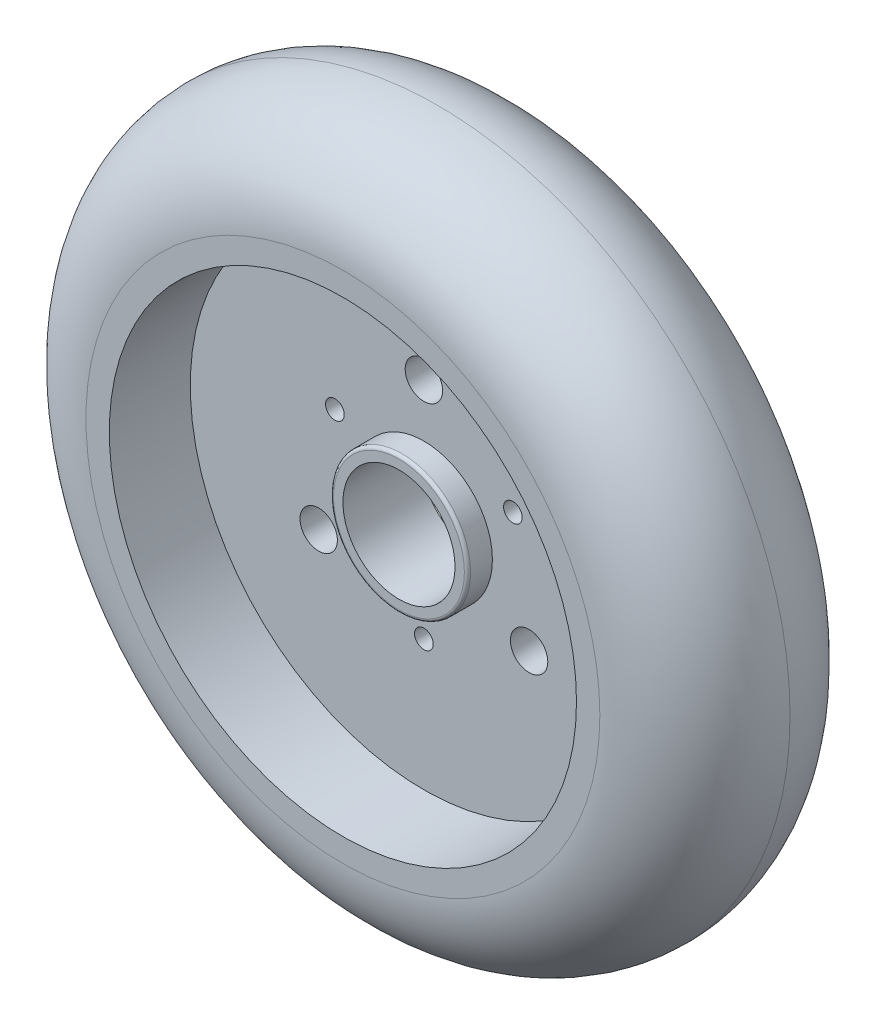
ISO-10303-21;
HEADER;
FILE_DESCRIPTION(('STEP AP214'),'2;1');
FILE_NAME('part.step','',(''),(''),'','','');
FILE_SCHEMA(('AUTOMOTIVE_DESIGN { 1 0 10303 214 1 1 1 1 }'));
ENDSEC;
DATA;
#1=APPLICATION_CONTEXT('core data for automotive mechanical design processes');
#2=APPLICATION_PROTOCOL_DEFINITION('international standard','automotive_design',2000,#1);
#3=PRODUCT_CONTEXT('',#1,'mechanical');
#4=PRODUCT('Part','Part','',(#3));
#5=PRODUCT_RELATED_PRODUCT_CATEGORY('part','',(#4));
#6=PRODUCT_DEFINITION_FORMATION('','',#4);
#7=PRODUCT_DEFINITION_CONTEXT('part definition',#1,'design');
#8=PRODUCT_DEFINITION('design','',#6,#7);
#9=PRODUCT_DEFINITION_SHAPE('','',#8);
#10=(LENGTH_UNIT() NAMED_UNIT(*) SI_UNIT(.MILLI.,.METRE.));
#11=(NAMED_UNIT(*) PLANE_ANGLE_UNIT() SI_UNIT($,.RADIAN.));
#12=(NAMED_UNIT(*) SI_UNIT($,.STERADIAN.) SOLID_ANGLE_UNIT());
#13=UNCERTAINTY_MEASURE_WITH_UNIT(LENGTH_MEASURE(1.E-05),#10,'distance_accuracy_value','');
#14=(GEOMETRIC_REPRESENTATION_CONTEXT(3) GLOBAL_UNCERTAINTY_ASSIGNED_CONTEXT((#13)) GLOBAL_UNIT_ASSIGNED_CONTEXT((#10,
#11,#12)) REPRESENTATION_CONTEXT('',''));
#15=CARTESIAN_POINT('',(0.,0.,0.));
#16=DIRECTION('',(0.,0.,1.));
#17=DIRECTION('',(1.,0.,0.));
#18=AXIS2_PLACEMENT_3D('',#15,#16,#17);
#19=CARTESIAN_POINT('',(0.,0.,8.90524));
#20=DIRECTION('',(0.,0.,1.));
#21=DIRECTION('',(1.,0.,0.));
#22=AXIS2_PLACEMENT_3D('',#19,#20,#21);
#23=PLANE('',#22);
#24=CARTESIAN_POINT('',(-7.2590249345212,4.19099999999993,8.90524));
#25=DIRECTION('',(0.,0.,1.));
#26=DIRECTION('',(-0.499999999999992,-0.866025403784443,0.));
#27=AXIS2_PLACEMENT_3D('',#24,#25,#26);
#28=CIRCLE('',#27,0.762);
#29=CARTESIAN_POINT('',(-7.6400249345212,3.53108864231619,8.90524));
#30=VERTEX_POINT('',#29);
#31=EDGE_CURVE('E57',#30,#30,#28,.T.);
#32=ORIENTED_EDGE('',*,*,#31,.F.);
#33=EDGE_LOOP('',(#32));
#34=FACE_BOUND('',#33,.T.);
#35=CARTESIAN_POINT('',(7.25902493452115,4.19100000000003,8.90524));
#36=DIRECTION('',(0.,0.,1.));
#37=DIRECTION('',(-0.500000000000004,0.866025403784436,0.));
#38=AXIS2_PLACEMENT_3D('',#35,#36,#37);
#39=CIRCLE('',#38,0.762);
#40=CARTESIAN_POINT('',(6.87802493452114,4.85091135768377,8.90524));
#41=VERTEX_POINT('',#40);
#42=EDGE_CURVE('E56',#41,#41,#39,.T.);
#43=ORIENTED_EDGE('',*,*,#42,.F.);
#44=EDGE_LOOP('',(#43));
#45=FACE_BOUND('',#44,.T.);
#46=CARTESIAN_POINT('',(0.,-8.382,8.90524));
#47=DIRECTION('',(0.,0.,1.));
#48=DIRECTION('',(1.,0.,0.));
#49=AXIS2_PLACEMENT_3D('',#46,#47,#48);
#50=CIRCLE('',#49,0.762);
#51=CARTESIAN_POINT('',(0.762,-8.382,8.90524));
#52=VERTEX_POINT('',#51);
#53=EDGE_CURVE('E61',#52,#52,#50,.T.);
#54=ORIENTED_EDGE('',*,*,#53,.F.);
#55=EDGE_LOOP('',(#54));
#56=FACE_BOUND('',#55,.T.);
#57=CARTESIAN_POINT('',(8.57884764988869,-4.95299999999992,8.90524));
#58=DIRECTION('',(0.,0.,1.));
#59=DIRECTION('',(-0.499999999999992,-0.866025403784443,0.));
#60=AXIS2_PLACEMENT_3D('',#57,#58,#59);
#61=CIRCLE('',#60,1.524);
#62=CARTESIAN_POINT('',(7.81684764988871,-6.27282271536741,8.90524));
#63=VERTEX_POINT('',#62);
#64=EDGE_CURVE('E65',#63,#63,#61,.T.);
#65=ORIENTED_EDGE('',*,*,#64,.F.);
#66=EDGE_LOOP('',(#65));
#67=FACE_BOUND('',#66,.T.);
#68=CARTESIAN_POINT('',(-8.57884764988863,-4.95300000000004,8.90524));
#69=DIRECTION('',(0.,0.,1.));
#70=DIRECTION('',(-0.500000000000004,0.866025403784436,0.));
#71=AXIS2_PLACEMENT_3D('',#68,#69,#70);
#72=CIRCLE('',#71,1.524);
#73=CARTESIAN_POINT('',(-9.34084764988863,-3.63317728463256,8.90524));
#74=VERTEX_POINT('',#73);
#75=EDGE_CURVE('E69',#74,#74,#72,.T.);
#76=ORIENTED_EDGE('',*,*,#75,.F.);
#77=EDGE_LOOP('',(#76));
#78=FACE_BOUND('',#77,.T.);
#79=CARTESIAN_POINT('',(0.,9.906,8.90524));
#80=DIRECTION('',(0.,0.,1.));
#81=DIRECTION('',(1.,0.,0.));
#82=AXIS2_PLACEMENT_3D('',#79,#80,#81);
#83=CIRCLE('',#82,1.524);
#84=CARTESIAN_POINT('',(1.524,9.906,8.90524));
#85=VERTEX_POINT('',#84);
#86=EDGE_CURVE('E73',#85,#85,#83,.T.);
#87=ORIENTED_EDGE('',*,*,#86,.F.);
#88=EDGE_LOOP('',(#87));
#89=FACE_BOUND('',#88,.T.);
#90=CARTESIAN_POINT('',(0.,0.,8.90524));
#91=DIRECTION('',(0.,0.,1.));
#92=DIRECTION('',(1.,0.,0.));
#93=AXIS2_PLACEMENT_3D('',#90,#91,#92);
#94=CIRCLE('',#93,19.05);
#95=CARTESIAN_POINT('',(19.05,0.,8.90524));
#96=VERTEX_POINT('',#95);
#97=EDGE_CURVE('E85',#96,#96,#94,.T.);
#98=ORIENTED_EDGE('',*,*,#97,.T.);
#99=EDGE_LOOP('',(#98));
#100=FACE_BOUND('',#99,.T.);
#101=CARTESIAN_POINT('',(0.,0.,8.90524));
#102=DIRECTION('',(0.,0.,1.));
#103=DIRECTION('',(1.,0.,0.));
#104=AXIS2_PLACEMENT_3D('',#101,#102,#103);
#105=CIRCLE('',#104,5.588);
#106=CARTESIAN_POINT('',(5.588,0.,8.90524));
#107=VERTEX_POINT('',#106);
#108=EDGE_CURVE('E99',#107,#107,#105,.T.);
#109=ORIENTED_EDGE('',*,*,#108,.F.);
#110=EDGE_LOOP('',(#109));
#111=FACE_BOUND('',#110,.T.);
#112=ADVANCED_FACE('F32',(#34,#45,#56,#67,#78,#89,#100,#111),#23,.T.);
#113=CARTESIAN_POINT('',(0.,0.,15.50924));
#114=DIRECTION('',(0.,0.,1.));
#115=DIRECTION('',(1.,0.,0.));
#116=AXIS2_PLACEMENT_3D('',#113,#114,#115);
#117=PLANE('',#116);
#118=CARTESIAN_POINT('',(0.,0.,15.50924));
#119=DIRECTION('',(0.,0.,1.));
#120=DIRECTION('',(1.,0.,0.));
#121=AXIS2_PLACEMENT_3D('',#118,#119,#120);
#122=CIRCLE('',#121,19.05);
#123=CARTESIAN_POINT('',(19.05,0.,15.50924));
#124=VERTEX_POINT('',#123);
#125=EDGE_CURVE('E90',#124,#124,#122,.T.);
#126=ORIENTED_EDGE('',*,*,#125,.F.);
#127=EDGE_LOOP('',(#126));
#128=FACE_BOUND('',#127,.T.);
#129=CARTESIAN_POINT('',(0.,0.,15.50924));
#130=DIRECTION('',(0.,0.,1.));
#131=DIRECTION('',(1.,0.,0.));
#132=AXIS2_PLACEMENT_3D('',#129,#130,#131);
#133=CIRCLE('',#132,20.95373);
#134=CARTESIAN_POINT('',(20.95373,0.,15.50924));
#135=VERTEX_POINT('',#134);
#136=EDGE_CURVE('E80',#135,#135,#133,.T.);
#137=ORIENTED_EDGE('',*,*,#136,.T.);
#138=EDGE_LOOP('',(#137));
#139=FACE_BOUND('',#138,.T.);
#140=ADVANCED_FACE('F126',(#128,#139),#117,.T.);
#141=CARTESIAN_POINT('',(0.,0.,0.));
#142=DIRECTION('',(0.,0.,1.));
#143=DIRECTION('',(1.,0.,0.));
#144=AXIS2_PLACEMENT_3D('',#141,#142,#143);
#145=PLANE('',#144);
#146=CARTESIAN_POINT('',(0.,0.,0.));
#147=DIRECTION('',(0.,0.,-1.));
#148=DIRECTION('',(-1.,0.,0.));
#149=AXIS2_PLACEMENT_3D('',#146,#147,#148);
#150=CIRCLE('',#149,19.05);
#151=CARTESIAN_POINT('',(-19.05,0.,0.));
#152=VERTEX_POINT('',#151);
#153=EDGE_CURVE('E96',#152,#152,#150,.T.);
#154=ORIENTED_EDGE('',*,*,#153,.F.);
#155=EDGE_LOOP('',(#154));
#156=FACE_BOUND('',#155,.T.);
#157=CARTESIAN_POINT('',(0.,0.,0.));
#158=DIRECTION('',(0.,0.,1.));
#159=DIRECTION('',(1.,0.,0.));
#160=AXIS2_PLACEMENT_3D('',#157,#158,#159);
#161=CIRCLE('',#160,20.95373);
#162=CARTESIAN_POINT('',(20.95373,0.,0.));
#163=VERTEX_POINT('',#162);
#164=EDGE_CURVE('E84',#163,#163,#161,.F.);
#165=ORIENTED_EDGE('',*,*,#164,.T.);
#166=EDGE_LOOP('',(#165));
#167=FACE_BOUND('',#166,.T.);
#168=ADVANCED_FACE('F173',(#156,#167),#145,.F.);
#169=CARTESIAN_POINT('',(0.,0.,7.75462));
#170=DIRECTION('',(0.,0.,1.));
#171=DIRECTION('',(1.,0.,0.));
#172=AXIS2_PLACEMENT_3D('',#169,#170,#171);
#173=TOROIDAL_SURFACE('',#172,20.95373,7.75462);
#174=ORIENTED_EDGE('',*,*,#136,.F.);
#175=EDGE_LOOP('',(#174));
#176=FACE_BOUND('',#175,.T.);
#177=CARTESIAN_POINT('',(0.,0.,7.75462));
#178=DIRECTION('',(0.,0.,1.));
#179=DIRECTION('',(1.,0.,0.));
#180=AXIS2_PLACEMENT_3D('',#177,#178,#179);
#181=CIRCLE('',#180,28.70835);
#182=CARTESIAN_POINT('',(28.70835,0.,7.75462));
#183=VERTEX_POINT('',#182);
#184=EDGE_CURVE('E81',#183,#183,#181,.F.);
#185=ORIENTED_EDGE('',*,*,#184,.F.);
#186=EDGE_LOOP('',(#185));
#187=FACE_BOUND('',#186,.T.);
#188=ADVANCED_FACE('F177',(#176,#187),#173,.T.);
#189=CARTESIAN_POINT('',(0.,0.,7.75462));
#190=DIRECTION('',(0.,0.,1.));
#191=DIRECTION('',(1.,0.,0.));
#192=AXIS2_PLACEMENT_3D('',#189,#190,#191);
#193=TOROIDAL_SURFACE('',#192,20.95373,7.75462);
#194=ORIENTED_EDGE('',*,*,#164,.F.);
#195=EDGE_LOOP('',(#194));
#196=FACE_BOUND('',#195,.T.);
#197=ORIENTED_EDGE('',*,*,#184,.T.);
#198=EDGE_LOOP('',(#197));
#199=FACE_BOUND('',#198,.T.);
#200=ADVANCED_FACE('F169',(#196,#199),#193,.T.);
#201=CARTESIAN_POINT('',(0.,0.,8.90524));
#202=DIRECTION('',(0.,0.,1.));
#203=DIRECTION('',(1.,0.,0.));
#204=AXIS2_PLACEMENT_3D('',#201,#202,#203);
#205=CYLINDRICAL_SURFACE('',#204,19.05);
#206=CARTESIAN_POINT('',(19.05,0.,8.90524));
#207=CARTESIAN_POINT('',(19.05,0.,8.97403166666667));
#208=CARTESIAN_POINT('',(19.05,0.,9.04282333333333));
#209=CARTESIAN_POINT('',(19.05,0.,9.18040666666667));
#210=CARTESIAN_POINT('',(19.05,0.,9.24919833333334));
#211=CARTESIAN_POINT('',(19.05,0.,9.38678166666667));
#212=CARTESIAN_POINT('',(19.05,0.,9.45557333333333));
#213=CARTESIAN_POINT('',(19.05,0.,9.59315666666667));
#214=CARTESIAN_POINT('',(19.05,0.,9.66194833333333));
#215=CARTESIAN_POINT('',(19.05,0.,9.79953166666667));
#216=CARTESIAN_POINT('',(19.05,0.,9.86832333333333));
#217=CARTESIAN_POINT('',(19.05,0.,10.0059066666667));
#218=CARTESIAN_POINT('',(19.05,0.,10.0746983333333));
#219=CARTESIAN_POINT('',(19.05,0.,10.2122816666667));
#220=CARTESIAN_POINT('',(19.05,0.,10.2810733333333));
#221=CARTESIAN_POINT('',(19.05,0.,10.4186566666667));
#222=CARTESIAN_POINT('',(19.05,0.,10.4874483333333));
#223=CARTESIAN_POINT('',(19.05,0.,10.6250316666667));
#224=CARTESIAN_POINT('',(19.05,0.,10.6938233333333));
#225=CARTESIAN_POINT('',(19.05,0.,10.8314066666667));
#226=CARTESIAN_POINT('',(19.05,0.,10.9001983333333));
#227=CARTESIAN_POINT('',(19.05,0.,11.0377816666667));
#228=CARTESIAN_POINT('',(19.05,0.,11.1065733333333));
#229=CARTESIAN_POINT('',(19.05,0.,11.2441566666667));
#230=CARTESIAN_POINT('',(19.05,0.,11.3129483333333));
#231=CARTESIAN_POINT('',(19.05,0.,11.4505316666667));
#232=CARTESIAN_POINT('',(19.05,0.,11.5193233333333));
#233=CARTESIAN_POINT('',(19.05,0.,11.6569066666667));
#234=CARTESIAN_POINT('',(19.05,0.,11.7256983333333));
#235=CARTESIAN_POINT('',(19.05,0.,11.8632816666667));
#236=CARTESIAN_POINT('',(19.05,0.,11.9320733333333));
#237=CARTESIAN_POINT('',(19.05,0.,12.0696566666667));
#238=CARTESIAN_POINT('',(19.05,0.,12.1384483333333));
#239=CARTESIAN_POINT('',(19.05,0.,12.2760316666667));
#240=CARTESIAN_POINT('',(19.05,0.,12.3448233333333));
#241=CARTESIAN_POINT('',(19.05,0.,12.4824066666667));
#242=CARTESIAN_POINT('',(19.05,0.,12.5511983333333));
#243=CARTESIAN_POINT('',(19.05,0.,12.6887816666667));
#244=CARTESIAN_POINT('',(19.05,0.,12.7575733333333));
#245=CARTESIAN_POINT('',(19.05,0.,12.8951566666667));
#246=CARTESIAN_POINT('',(19.05,0.,12.9639483333333));
#247=CARTESIAN_POINT('',(19.05,0.,13.1015316666667));
#248=CARTESIAN_POINT('',(19.05,0.,13.1703233333333));
#249=CARTESIAN_POINT('',(19.05,0.,13.3079066666667));
#250=CARTESIAN_POINT('',(19.05,0.,13.3766983333333));
#251=CARTESIAN_POINT('',(19.05,0.,13.5142816666667));
#252=CARTESIAN_POINT('',(19.05,0.,13.5830733333333));
#253=CARTESIAN_POINT('',(19.05,0.,13.7206566666667));
#254=CARTESIAN_POINT('',(19.05,0.,13.7894483333333));
#255=CARTESIAN_POINT('',(19.05,0.,13.9270316666667));
#256=CARTESIAN_POINT('',(19.05,0.,13.9958233333333));
#257=CARTESIAN_POINT('',(19.05,0.,14.1334066666667));
#258=CARTESIAN_POINT('',(19.05,0.,14.2021983333333));
#259=CARTESIAN_POINT('',(19.05,0.,14.3397816666667));
#260=CARTESIAN_POINT('',(19.05,0.,14.4085733333333));
#261=CARTESIAN_POINT('',(19.05,0.,14.5461566666667));
#262=CARTESIAN_POINT('',(19.05,0.,14.6149483333333));
#263=CARTESIAN_POINT('',(19.05,0.,14.7525316666667));
#264=CARTESIAN_POINT('',(19.05,0.,14.8213233333333));
#265=CARTESIAN_POINT('',(19.05,0.,14.9589066666667));
#266=CARTESIAN_POINT('',(19.05,0.,15.0276983333333));
#267=CARTESIAN_POINT('',(19.05,0.,15.1652816666667));
#268=CARTESIAN_POINT('',(19.05,0.,15.2340733333333));
#269=CARTESIAN_POINT('',(19.05,0.,15.3716566666667));
#270=CARTESIAN_POINT('',(19.05,0.,15.4404483333333));
#271=CARTESIAN_POINT('',(19.05,0.,15.50924));
#272=B_SPLINE_CURVE_WITH_KNOTS('',3,(#206,#207,#208,#209,#210,#211,#212,#213,#214,#215,#216,
#217,#218,#219,#220,#221,#222,#223,#224,#225,#226,#227,#228,#229,#230,#231,#232,#233,#234,#235,
#236,#237,#238,#239,#240,#241,#242,#243,#244,#245,#246,#247,#248,#249,#250,#251,#252,#253,#254,
#255,#256,#257,#258,#259,#260,#261,#262,#263,#264,#265,#266,#267,#268,#269,#270,#271),
.UNSPECIFIED.,.F.,.F.,(4,2,2,2,2,2,2,2,2,2,2,2,2,2,2,2,2,2,2,2,2,2,2,2,2,2,2,2,2,2,2,2,4),(0.,
0.206374999999998,0.41275,0.619124999999998,0.8255,1.031875,1.23825,1.444625,1.651,1.857375,
2.06375,2.270125,2.4765,2.682875,2.88925,3.095625,3.302,3.508375,3.71475,3.921125,4.1275,
4.333875,4.54025,4.746625,4.953,5.159375,5.36575,5.572125,5.7785,5.984875,6.19125,6.397625,
6.604),.UNSPECIFIED.);
#273=EDGE_CURVE('BSEAM164',#96,#124,#272,.T.);
#274=ORIENTED_EDGE('',*,*,#97,.F.);
#275=ORIENTED_EDGE('',*,*,#125,.T.);
#276=ORIENTED_EDGE('',*,*,#273,.T.);
#277=ORIENTED_EDGE('',*,*,#273,.F.);
#278=EDGE_LOOP('',(#274,#276,#275,#277));
#279=FACE_BOUND('',#278,.T.);
#280=ADVANCED_FACE('F164',(#279),#205,.F.);
#281=CARTESIAN_POINT('',(0.,0.,6.604));
#282=DIRECTION('',(0.,0.,-1.));
#283=DIRECTION('',(-1.,0.,0.));
#284=AXIS2_PLACEMENT_3D('',#281,#282,#283);
#285=CYLINDRICAL_SURFACE('',#284,19.05);
#286=CARTESIAN_POINT('',(0.,0.,6.604));
#287=DIRECTION('',(0.,0.,-1.));
#288=DIRECTION('',(-1.,0.,0.));
#289=AXIS2_PLACEMENT_3D('',#286,#287,#288);
#290=CIRCLE('',#289,19.05);
#291=CARTESIAN_POINT('',(-19.05,0.,6.604));
#292=VERTEX_POINT('',#291);
#293=EDGE_CURVE('E93',#292,#292,#290,.T.);
#294=CARTESIAN_POINT('',(-19.05,0.,6.604));
#295=CARTESIAN_POINT('',(-19.05,0.,6.53520833333333));
#296=CARTESIAN_POINT('',(-19.05,0.,6.46641666666667));
#297=CARTESIAN_POINT('',(-19.05,0.,6.32883333333333));
#298=CARTESIAN_POINT('',(-19.05,0.,6.26004166666667));
#299=CARTESIAN_POINT('',(-19.05,0.,6.12245833333333));
#300=CARTESIAN_POINT('',(-19.05,0.,6.05366666666667));
#301=CARTESIAN_POINT('',(-19.05,0.,5.91608333333333));
#302=CARTESIAN_POINT('',(-19.05,0.,5.84729166666667));
#303=CARTESIAN_POINT('',(-19.05,0.,5.70970833333333));
#304=CARTESIAN_POINT('',(-19.05,0.,5.64091666666667));
#305=CARTESIAN_POINT('',(-19.05,0.,5.50333333333333));
#306=CARTESIAN_POINT('',(-19.05,0.,5.43454166666667));
#307=CARTESIAN_POINT('',(-19.05,0.,5.29695833333333));
#308=CARTESIAN_POINT('',(-19.05,0.,5.22816666666667));
#309=CARTESIAN_POINT('',(-19.05,0.,5.09058333333333));
#310=CARTESIAN_POINT('',(-19.05,0.,5.02179166666667));
#311=CARTESIAN_POINT('',(-19.05,0.,4.88420833333333));
#312=CARTESIAN_POINT('',(-19.05,0.,4.81541666666667));
#313=CARTESIAN_POINT('',(-19.05,0.,4.67783333333333));
#314=CARTESIAN_POINT('',(-19.05,0.,4.60904166666667));
#315=CARTESIAN_POINT('',(-19.05,0.,4.47145833333333));
#316=CARTESIAN_POINT('',(-19.05,0.,4.40266666666667));
#317=CARTESIAN_POINT('',(-19.05,0.,4.26508333333333));
#318=CARTESIAN_POINT('',(-19.05,0.,4.19629166666667));
#319=CARTESIAN_POINT('',(-19.05,0.,4.05870833333333));
#320=CARTESIAN_POINT('',(-19.05,0.,3.98991666666667));
#321=CARTESIAN_POINT('',(-19.05,0.,3.85233333333333));
#322=CARTESIAN_POINT('',(-19.05,0.,3.78354166666667));
#323=CARTESIAN_POINT('',(-19.05,0.,3.64595833333333));
#324=CARTESIAN_POINT('',(-19.05,0.,3.57716666666667));
#325=CARTESIAN_POINT('',(-19.05,0.,3.43958333333333));
#326=CARTESIAN_POINT('',(-19.05,0.,3.37079166666667));
#327=CARTESIAN_POINT('',(-19.05,0.,3.23320833333333));
#328=CARTESIAN_POINT('',(-19.05,0.,3.16441666666667));
#329=CARTESIAN_POINT('',(-19.05,0.,3.02683333333333));
#330=CARTESIAN_POINT('',(-19.05,0.,2.95804166666667));
#331=CARTESIAN_POINT('',(-19.05,0.,2.82045833333333));
#332=CARTESIAN_POINT('',(-19.05,0.,2.75166666666667));
#333=CARTESIAN_POINT('',(-19.05,0.,2.61408333333333));
#334=CARTESIAN_POINT('',(-19.05,0.,2.54529166666667));
#335=CARTESIAN_POINT('',(-19.05,0.,2.40770833333333));
#336=CARTESIAN_POINT('',(-19.05,0.,2.33891666666667));
#337=CARTESIAN_POINT('',(-19.05,0.,2.20133333333333));
#338=CARTESIAN_POINT('',(-19.05,0.,2.13254166666667));
#339=CARTESIAN_POINT('',(-19.05,0.,1.99495833333333));
#340=CARTESIAN_POINT('',(-19.05,0.,1.92616666666667));
#341=CARTESIAN_POINT('',(-19.05,0.,1.78858333333333));
#342=CARTESIAN_POINT('',(-19.05,0.,1.71979166666667));
#343=CARTESIAN_POINT('',(-19.05,0.,1.58220833333333));
#344=CARTESIAN_POINT('',(-19.05,0.,1.51341666666667));
#345=CARTESIAN_POINT('',(-19.05,0.,1.37583333333333));
#346=CARTESIAN_POINT('',(-19.05,0.,1.30704166666667));
#347=CARTESIAN_POINT('',(-19.05,0.,1.16945833333333));
#348=CARTESIAN_POINT('',(-19.05,0.,1.10066666666667));
#349=CARTESIAN_POINT('',(-19.05,0.,0.963083333333333));
#350=CARTESIAN_POINT('',(-19.05,0.,0.894291666666666));
#351=CARTESIAN_POINT('',(-19.05,0.,0.756708333333333));
#352=CARTESIAN_POINT('',(-19.05,0.,0.687916666666667));
#353=CARTESIAN_POINT('',(-19.05,0.,0.550333333333333));
#354=CARTESIAN_POINT('',(-19.05,0.,0.481541666666667));
#355=CARTESIAN_POINT('',(-19.05,0.,0.343958333333333));
#356=CARTESIAN_POINT('',(-19.05,0.,0.275166666666667));
#357=CARTESIAN_POINT('',(-19.05,0.,0.137583333333333));
#358=CARTESIAN_POINT('',(-19.05,0.,0.0687916666666666));
#359=CARTESIAN_POINT('',(-19.05,0.,0.));
#360=B_SPLINE_CURVE_WITH_KNOTS('',3,(#294,#295,#296,#297,#298,#299,#300,#301,#302,#303,#304,
#305,#306,#307,#308,#309,#310,#311,#312,#313,#314,#315,#316,#317,#318,#319,#320,#321,#322,#323,
#324,#325,#326,#327,#328,#329,#330,#331,#332,#333,#334,#335,#336,#337,#338,#339,#340,#341,#342,
#343,#344,#345,#346,#347,#348,#349,#350,#351,#352,#353,#354,#355,#356,#357,#358,#359),
.UNSPECIFIED.,.F.,.F.,(4,2,2,2,2,2,2,2,2,2,2,2,2,2,2,2,2,2,2,2,2,2,2,2,2,2,2,2,2,2,2,2,4),(0.,
0.206375,0.41275,0.619125,0.8255,1.031875,1.23825,1.444625,1.651,1.857375,2.06375,2.270125,
2.4765,2.682875,2.88925,3.095625,3.302,3.508375,3.71475,3.921125,4.1275,4.333875,4.54025,
4.746625,4.953,5.159375,5.36575,5.572125,5.7785,5.984875,6.19125,6.397625,6.604),.UNSPECIFIED.);
#361=EDGE_CURVE('BSEAM161',#292,#152,#360,.T.);
#362=ORIENTED_EDGE('',*,*,#293,.F.);
#363=ORIENTED_EDGE('',*,*,#153,.T.);
#364=ORIENTED_EDGE('',*,*,#361,.T.);
#365=ORIENTED_EDGE('',*,*,#361,.F.);
#366=EDGE_LOOP('',(#362,#364,#363,#365));
#367=FACE_BOUND('',#366,.T.);
#368=ADVANCED_FACE('F161',(#367),#285,.F.);
#369=CARTESIAN_POINT('',(0.,0.,6.604));
#370=DIRECTION('',(0.,0.,-1.));
#371=DIRECTION('',(-1.,0.,0.));
#372=AXIS2_PLACEMENT_3D('',#369,#370,#371);
#373=PLANE('',#372);
#374=CARTESIAN_POINT('',(-7.2590249345212,4.19099999999993,6.604));
#375=DIRECTION('',(0.,0.,-1.));
#376=DIRECTION('',(-1.,0.,0.));
#377=AXIS2_PLACEMENT_3D('',#374,#375,#376);
#378=CIRCLE('',#377,0.762);
#379=CARTESIAN_POINT('',(-8.0210249345212,4.19099999999993,6.604));
#380=VERTEX_POINT('',#379);
#381=EDGE_CURVE('E53',#380,#380,#378,.T.);
#382=ORIENTED_EDGE('',*,*,#381,.F.);
#383=EDGE_LOOP('',(#382));
#384=FACE_BOUND('',#383,.T.);
#385=CARTESIAN_POINT('',(7.25902493452115,4.19100000000003,6.604));
#386=DIRECTION('',(0.,0.,-1.));
#387=DIRECTION('',(-1.,0.,0.));
#388=AXIS2_PLACEMENT_3D('',#385,#386,#387);
#389=CIRCLE('',#388,0.762);
#390=CARTESIAN_POINT('',(6.49702493452115,4.19100000000003,6.604));
#391=VERTEX_POINT('',#390);
#392=EDGE_CURVE('E58',#391,#391,#389,.T.);
#393=ORIENTED_EDGE('',*,*,#392,.F.);
#394=EDGE_LOOP('',(#393));
#395=FACE_BOUND('',#394,.T.);
#396=CARTESIAN_POINT('',(0.,-8.382,6.604));
#397=DIRECTION('',(0.,0.,-1.));
#398=DIRECTION('',(-1.,0.,0.));
#399=AXIS2_PLACEMENT_3D('',#396,#397,#398);
#400=CIRCLE('',#399,0.762);
#401=CARTESIAN_POINT('',(-0.762,-8.382,6.604));
#402=VERTEX_POINT('',#401);
#403=EDGE_CURVE('E62',#402,#402,#400,.T.);
#404=ORIENTED_EDGE('',*,*,#403,.F.);
#405=EDGE_LOOP('',(#404));
#406=FACE_BOUND('',#405,.T.);
#407=CARTESIAN_POINT('',(8.57884764988869,-4.95299999999992,6.604));
#408=DIRECTION('',(0.,0.,-1.));
#409=DIRECTION('',(-1.,0.,0.));
#410=AXIS2_PLACEMENT_3D('',#407,#408,#409);
#411=CIRCLE('',#410,1.524);
#412=CARTESIAN_POINT('',(7.05484764988869,-4.95299999999992,6.604));
#413=VERTEX_POINT('',#412);
#414=EDGE_CURVE('E66',#413,#413,#411,.T.);
#415=ORIENTED_EDGE('',*,*,#414,.F.);
#416=EDGE_LOOP('',(#415));
#417=FACE_BOUND('',#416,.T.);
#418=CARTESIAN_POINT('',(-8.57884764988863,-4.95300000000004,6.604));
#419=DIRECTION('',(0.,0.,-1.));
#420=DIRECTION('',(-1.,0.,0.));
#421=AXIS2_PLACEMENT_3D('',#418,#419,#420);
#422=CIRCLE('',#421,1.524);
#423=CARTESIAN_POINT('',(-10.1028476498886,-4.95300000000004,6.604));
#424=VERTEX_POINT('',#423);
#425=EDGE_CURVE('E70',#424,#424,#422,.T.);
#426=ORIENTED_EDGE('',*,*,#425,.F.);
#427=EDGE_LOOP('',(#426));
#428=FACE_BOUND('',#427,.T.);
#429=CARTESIAN_POINT('',(0.,9.906,6.604));
#430=DIRECTION('',(0.,0.,-1.));
#431=DIRECTION('',(-1.,0.,0.));
#432=AXIS2_PLACEMENT_3D('',#429,#430,#431);
#433=CIRCLE('',#432,1.524);
#434=CARTESIAN_POINT('',(-1.524,9.906,6.604));
#435=VERTEX_POINT('',#434);
#436=EDGE_CURVE('E74',#435,#435,#433,.T.);
#437=ORIENTED_EDGE('',*,*,#436,.F.);
#438=EDGE_LOOP('',(#437));
#439=FACE_BOUND('',#438,.T.);
#440=CARTESIAN_POINT('',(0.,0.,6.604));
#441=DIRECTION('',(0.,0.,-1.));
#442=DIRECTION('',(-1.,0.,0.));
#443=AXIS2_PLACEMENT_3D('',#440,#441,#442);
#444=CIRCLE('',#443,5.588);
#445=CARTESIAN_POINT('',(-5.588,0.,6.604));
#446=VERTEX_POINT('',#445);
#447=EDGE_CURVE('E52',#446,#446,#444,.T.);
#448=ORIENTED_EDGE('',*,*,#447,.F.);
#449=EDGE_LOOP('',(#448));
#450=FACE_BOUND('',#449,.T.);
#451=ORIENTED_EDGE('',*,*,#293,.T.);
#452=EDGE_LOOP('',(#451));
#453=FACE_BOUND('',#452,.T.);
#454=ADVANCED_FACE('F155',(#384,#395,#406,#417,#428,#439,#450,#453),#373,.T.);
#455=CARTESIAN_POINT('',(0.,0.,10.93724));
#456=DIRECTION('',(0.,0.,1.));
#457=DIRECTION('',(1.,0.,0.));
#458=AXIS2_PLACEMENT_3D('',#455,#456,#457);
#459=PLANE('',#458);
#460=CARTESIAN_POINT('',(0.,0.,10.93724));
#461=DIRECTION('',(0.,0.,1.));
#462=DIRECTION('',(1.,0.,0.));
#463=AXIS2_PLACEMENT_3D('',#460,#461,#462);
#464=CIRCLE('',#463,5.334);
#465=CARTESIAN_POINT('',(5.334,0.,10.93724));
#466=VERTEX_POINT('',#465);
#467=EDGE_CURVE('E47',#466,#466,#464,.T.);
#468=ORIENTED_EDGE('',*,*,#467,.T.);
#469=EDGE_LOOP('',(#468));
#470=FACE_BOUND('',#469,.T.);
#471=CARTESIAN_POINT('',(0.,0.,10.93724));
#472=DIRECTION('',(0.,0.,1.));
#473=DIRECTION('',(1.,0.,0.));
#474=AXIS2_PLACEMENT_3D('',#471,#472,#473);
#475=CIRCLE('',#474,4.572);
#476=CARTESIAN_POINT('',(4.572,0.,10.93724));
#477=VERTEX_POINT('',#476);
#478=EDGE_CURVE('E104',#477,#477,#475,.T.);
#479=ORIENTED_EDGE('',*,*,#478,.F.);
#480=EDGE_LOOP('',(#479));
#481=FACE_BOUND('',#480,.T.);
#482=ADVANCED_FACE('F145',(#470,#481),#459,.T.);
#483=CARTESIAN_POINT('',(0.,0.,10.93724));
#484=DIRECTION('',(0.,0.,-1.));
#485=DIRECTION('',(-1.,0.,0.));
#486=AXIS2_PLACEMENT_3D('',#483,#484,#485);
#487=CYLINDRICAL_SURFACE('',#486,5.588);
#488=CARTESIAN_POINT('',(0.,0.,10.68324));
#489=DIRECTION('',(0.,0.,1.));
#490=DIRECTION('',(1.,0.,0.));
#491=AXIS2_PLACEMENT_3D('',#488,#489,#490);
#492=CIRCLE('',#491,5.588);
#493=CARTESIAN_POINT('',(5.588,0.,10.68324));
#494=VERTEX_POINT('',#493);
#495=EDGE_CURVE('E43',#494,#494,#492,.F.);
#496=ORIENTED_EDGE('',*,*,#495,.T.);
#497=EDGE_LOOP('',(#496));
#498=FACE_BOUND('',#497,.T.);
#499=ORIENTED_EDGE('',*,*,#108,.T.);
#500=EDGE_LOOP('',(#499));
#501=FACE_BOUND('',#500,.T.);
#502=ADVANCED_FACE('F142',(#498,#501),#487,.T.);
#503=CARTESIAN_POINT('',(0.,0.,10.93724));
#504=DIRECTION('',(0.,0.,-1.));
#505=DIRECTION('',(-1.,0.,0.));
#506=AXIS2_PLACEMENT_3D('',#503,#504,#505);
#507=CYLINDRICAL_SURFACE('',#506,4.572);
#508=ORIENTED_EDGE('',*,*,#478,.T.);
#509=EDGE_LOOP('',(#508));
#510=FACE_BOUND('',#509,.T.);
#511=CARTESIAN_POINT('',(0.,0.,4.572));
#512=DIRECTION('',(0.,0.,1.));
#513=DIRECTION('',(1.,0.,0.));
#514=AXIS2_PLACEMENT_3D('',#511,#512,#513);
#515=CIRCLE('',#514,4.572);
#516=CARTESIAN_POINT('',(4.572,0.,4.572));
#517=VERTEX_POINT('',#516);
#518=EDGE_CURVE('E77',#517,#517,#515,.T.);
#519=ORIENTED_EDGE('',*,*,#518,.F.);
#520=EDGE_LOOP('',(#519));
#521=FACE_BOUND('',#520,.T.);
#522=ADVANCED_FACE('F144',(#510,#521),#507,.F.);
#523=CARTESIAN_POINT('',(0.,0.,4.572));
#524=DIRECTION('',(0.,0.,1.));
#525=DIRECTION('',(1.,0.,0.));
#526=AXIS2_PLACEMENT_3D('',#523,#524,#525);
#527=CYLINDRICAL_SURFACE('',#526,5.588);
#528=CARTESIAN_POINT('',(0.,0.,4.826));
#529=DIRECTION('',(0.,0.,-1.));
#530=DIRECTION('',(-1.,0.,0.));
#531=AXIS2_PLACEMENT_3D('',#528,#529,#530);
#532=CIRCLE('',#531,5.588);
#533=CARTESIAN_POINT('',(-5.588,0.,4.826));
#534=VERTEX_POINT('',#533);
#535=EDGE_CURVE('E39',#534,#534,#532,.F.);
#536=ORIENTED_EDGE('',*,*,#535,.T.);
#537=EDGE_LOOP('',(#536));
#538=FACE_BOUND('',#537,.T.);
#539=ORIENTED_EDGE('',*,*,#447,.T.);
#540=EDGE_LOOP('',(#539));
#541=FACE_BOUND('',#540,.T.);
#542=ADVANCED_FACE('F152',(#538,#541),#527,.T.);
#543=CARTESIAN_POINT('',(0.,0.,4.572));
#544=DIRECTION('',(0.,0.,-1.));
#545=DIRECTION('',(1.,0.,0.));
#546=AXIS2_PLACEMENT_3D('',#543,#544,#545);
#547=PLANE('',#546);
#548=CARTESIAN_POINT('',(0.,0.,4.572));
#549=DIRECTION('',(0.,0.,-1.));
#550=DIRECTION('',(-1.,0.,0.));
#551=AXIS2_PLACEMENT_3D('',#548,#549,#550);
#552=CIRCLE('',#551,5.334);
#553=CARTESIAN_POINT('',(-5.334,0.,4.572));
#554=VERTEX_POINT('',#553);
#555=EDGE_CURVE('E10',#554,#554,#552,.T.);
#556=ORIENTED_EDGE('',*,*,#555,.T.);
#557=EDGE_LOOP('',(#556));
#558=FACE_BOUND('',#557,.T.);
#559=ORIENTED_EDGE('',*,*,#518,.T.);
#560=EDGE_LOOP('',(#559));
#561=FACE_BOUND('',#560,.T.);
#562=ADVANCED_FACE('F203',(#558,#561),#547,.T.);
#563=CARTESIAN_POINT('',(0.,9.906,-2.52476000000001));
#564=DIRECTION('',(0.,0.,1.));
#565=DIRECTION('',(1.,0.,0.));
#566=AXIS2_PLACEMENT_3D('',#563,#564,#565);
#567=CYLINDRICAL_SURFACE('',#566,1.524);
#568=ORIENTED_EDGE('',*,*,#436,.T.);
#569=EDGE_LOOP('',(#568));
#570=FACE_BOUND('',#569,.T.);
#571=ORIENTED_EDGE('',*,*,#86,.T.);
#572=EDGE_LOOP('',(#571));
#573=FACE_BOUND('',#572,.T.);
#574=ADVANCED_FACE('F205',(#570,#573),#567,.F.);
#575=CARTESIAN_POINT('',(-8.57884764988863,-4.95300000000004,-2.52476000000001));
#576=DIRECTION('',(0.,0.,1.));
#577=DIRECTION('',(1.,0.,0.));
#578=AXIS2_PLACEMENT_3D('',#575,#576,#577);
#579=CYLINDRICAL_SURFACE('',#578,1.524);
#580=ORIENTED_EDGE('',*,*,#425,.T.);
#581=EDGE_LOOP('',(#580));
#582=FACE_BOUND('',#581,.T.);
#583=ORIENTED_EDGE('',*,*,#75,.T.);
#584=EDGE_LOOP('',(#583));
#585=FACE_BOUND('',#584,.T.);
#586=ADVANCED_FACE('F211',(#582,#585),#579,.F.);
#587=CARTESIAN_POINT('',(8.57884764988869,-4.95299999999992,-2.52476000000001));
#588=DIRECTION('',(0.,0.,1.));
#589=DIRECTION('',(1.,0.,0.));
#590=AXIS2_PLACEMENT_3D('',#587,#588,#589);
#591=CYLINDRICAL_SURFACE('',#590,1.524);
#592=ORIENTED_EDGE('',*,*,#414,.T.);
#593=EDGE_LOOP('',(#592));
#594=FACE_BOUND('',#593,.T.);
#595=ORIENTED_EDGE('',*,*,#64,.T.);
#596=EDGE_LOOP('',(#595));
#597=FACE_BOUND('',#596,.T.);
#598=ADVANCED_FACE('F218',(#594,#597),#591,.F.);
#599=CARTESIAN_POINT('',(0.,-8.382,-2.52476000000001));
#600=DIRECTION('',(0.,0.,1.));
#601=DIRECTION('',(1.,0.,0.));
#602=AXIS2_PLACEMENT_3D('',#599,#600,#601);
#603=CYLINDRICAL_SURFACE('',#602,0.762);
#604=ORIENTED_EDGE('',*,*,#403,.T.);
#605=EDGE_LOOP('',(#604));
#606=FACE_BOUND('',#605,.T.);
#607=ORIENTED_EDGE('',*,*,#53,.T.);
#608=EDGE_LOOP('',(#607));
#609=FACE_BOUND('',#608,.T.);
#610=ADVANCED_FACE('F222',(#606,#609),#603,.F.);
#611=CARTESIAN_POINT('',(7.25902493452115,4.19100000000003,-2.52476000000001));
#612=DIRECTION('',(0.,0.,1.));
#613=DIRECTION('',(1.,0.,0.));
#614=AXIS2_PLACEMENT_3D('',#611,#612,#613);
#615=CYLINDRICAL_SURFACE('',#614,0.762);
#616=ORIENTED_EDGE('',*,*,#392,.T.);
#617=EDGE_LOOP('',(#616));
#618=FACE_BOUND('',#617,.T.);
#619=ORIENTED_EDGE('',*,*,#42,.T.);
#620=EDGE_LOOP('',(#619));
#621=FACE_BOUND('',#620,.T.);
#622=ADVANCED_FACE('F192',(#618,#621),#615,.F.);
#623=CARTESIAN_POINT('',(-7.2590249345212,4.19099999999993,-2.52476000000001));
#624=DIRECTION('',(0.,0.,1.));
#625=DIRECTION('',(1.,0.,0.));
#626=AXIS2_PLACEMENT_3D('',#623,#624,#625);
#627=CYLINDRICAL_SURFACE('',#626,0.762);
#628=ORIENTED_EDGE('',*,*,#381,.T.);
#629=EDGE_LOOP('',(#628));
#630=FACE_BOUND('',#629,.T.);
#631=ORIENTED_EDGE('',*,*,#31,.T.);
#632=EDGE_LOOP('',(#631));
#633=FACE_BOUND('',#632,.T.);
#634=ADVANCED_FACE('F122',(#630,#633),#627,.F.);
#635=CARTESIAN_POINT('',(0.,0.,10.68324));
#636=DIRECTION('',(0.,0.,1.));
#637=DIRECTION('',(1.,0.,0.));
#638=AXIS2_PLACEMENT_3D('',#635,#636,#637);
#639=TOROIDAL_SURFACE('',#638,5.334,0.254);
#640=ORIENTED_EDGE('',*,*,#495,.F.);
#641=EDGE_LOOP('',(#640));
#642=FACE_BOUND('',#641,.T.);
#643=ORIENTED_EDGE('',*,*,#467,.F.);
#644=EDGE_LOOP('',(#643));
#645=FACE_BOUND('',#644,.T.);
#646=ADVANCED_FACE('F184',(#642,#645),#639,.T.);
#647=CARTESIAN_POINT('',(0.,0.,4.826));
#648=DIRECTION('',(0.,0.,-1.));
#649=DIRECTION('',(-1.,0.,0.));
#650=AXIS2_PLACEMENT_3D('',#647,#648,#649);
#651=TOROIDAL_SURFACE('',#650,5.334,0.254);
#652=ORIENTED_EDGE('',*,*,#555,.F.);
#653=EDGE_LOOP('',(#652));
#654=FACE_BOUND('',#653,.T.);
#655=ORIENTED_EDGE('',*,*,#535,.F.);
#656=EDGE_LOOP('',(#655));
#657=FACE_BOUND('',#656,.T.);
#658=ADVANCED_FACE('F34',(#654,#657),#651,.T.);
#659=CLOSED_SHELL('',(#112,#140,#168,#188,#200,#280,#368,#454,#482,#502,#522,#542,#562,#574,
#586,#598,#610,#622,#634,#646,#658));
#660=MANIFOLD_SOLID_BREP('B2',#659);
#661=ADVANCED_BREP_SHAPE_REPRESENTATION('',(#18,#660),#14);
#662=SHAPE_DEFINITION_REPRESENTATION(#9,#661);
ENDSEC;
END-ISO-10303-21;
